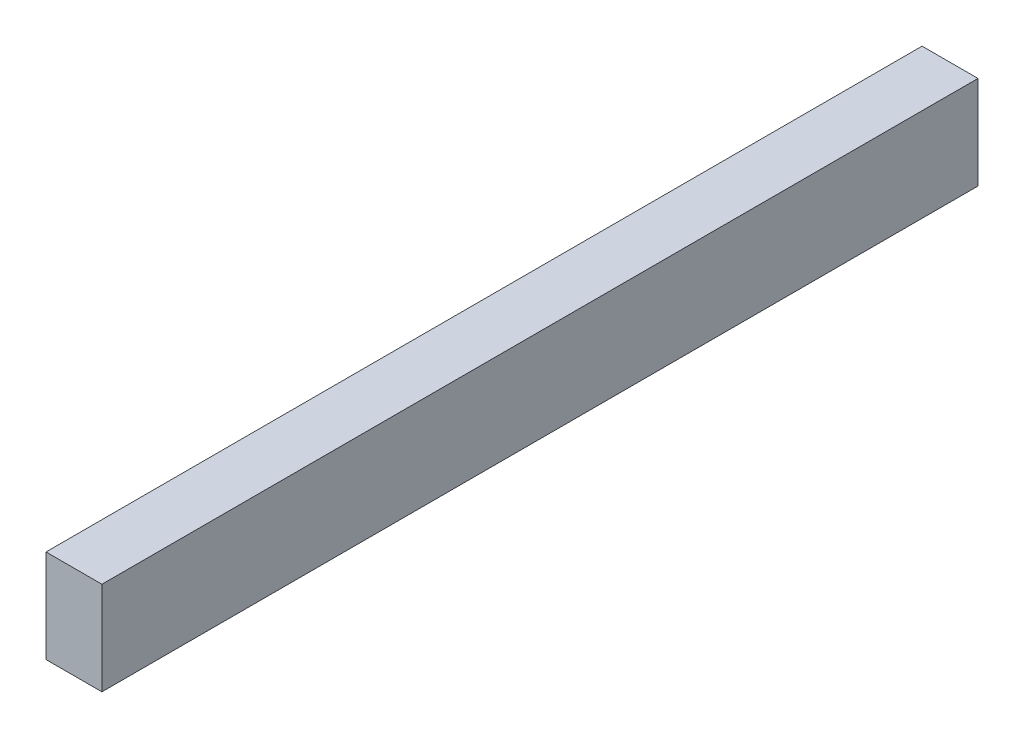
ISO-10303-21;
HEADER;
FILE_DESCRIPTION(('STEP AP214'),'2;1');
FILE_NAME('part.step','',(''),(''),'','','');
FILE_SCHEMA(('AUTOMOTIVE_DESIGN { 1 0 10303 214 1 1 1 1 }'));
ENDSEC;
DATA;
#1=APPLICATION_CONTEXT('core data for automotive mechanical design processes');
#2=APPLICATION_PROTOCOL_DEFINITION('international standard','automotive_design',2000,#1);
#3=PRODUCT_CONTEXT('',#1,'mechanical');
#4=PRODUCT('Part','Part','',(#3));
#5=PRODUCT_RELATED_PRODUCT_CATEGORY('part','',(#4));
#6=PRODUCT_DEFINITION_FORMATION('','',#4);
#7=PRODUCT_DEFINITION_CONTEXT('part definition',#1,'design');
#8=PRODUCT_DEFINITION('design','',#6,#7);
#9=PRODUCT_DEFINITION_SHAPE('','',#8);
#10=(LENGTH_UNIT() NAMED_UNIT(*) SI_UNIT(.MILLI.,.METRE.));
#11=(NAMED_UNIT(*) PLANE_ANGLE_UNIT() SI_UNIT($,.RADIAN.));
#12=(NAMED_UNIT(*) SI_UNIT($,.STERADIAN.) SOLID_ANGLE_UNIT());
#13=UNCERTAINTY_MEASURE_WITH_UNIT(LENGTH_MEASURE(1.E-05),#10,'distance_accuracy_value','');
#14=(GEOMETRIC_REPRESENTATION_CONTEXT(3) GLOBAL_UNCERTAINTY_ASSIGNED_CONTEXT((#13)) GLOBAL_UNIT_ASSIGNED_CONTEXT((#10,
#11,#12)) REPRESENTATION_CONTEXT('',''));
#15=CARTESIAN_POINT('',(0.,0.,0.));
#16=DIRECTION('',(0.,0.,1.));
#17=DIRECTION('',(1.,0.,0.));
#18=AXIS2_PLACEMENT_3D('',#15,#16,#17);
#19=CARTESIAN_POINT('',(19.05,-31.75,596.9));
#20=DIRECTION('',(-1.,0.,0.));
#21=DIRECTION('',(0.,0.,1.));
#22=AXIS2_PLACEMENT_3D('',#19,#20,#21);
#23=PLANE('',#22);
#24=DIRECTION('',(0.,1.,0.));
#25=VECTOR('',#24,1.);
#26=CARTESIAN_POINT('',(19.05,-31.75,0.));
#27=LINE('',#26,#25);
#28=CARTESIAN_POINT('',(19.05,-31.75,0.));
#29=VERTEX_POINT('',#28);
#30=CARTESIAN_POINT('',(19.05,31.75,0.));
#31=VERTEX_POINT('',#30);
#32=EDGE_CURVE('E96',#29,#31,#27,.T.);
#33=ORIENTED_EDGE('',*,*,#32,.T.);
#34=DIRECTION('',(0.,0.,-1.));
#35=VECTOR('',#34,1.);
#36=CARTESIAN_POINT('',(19.05,31.75,596.9));
#37=LINE('',#36,#35);
#38=CARTESIAN_POINT('',(19.05,31.75,596.9));
#39=VERTEX_POINT('',#38);
#40=EDGE_CURVE('E11',#39,#31,#37,.T.);
#41=ORIENTED_EDGE('',*,*,#40,.F.);
#42=DIRECTION('',(0.,1.,0.));
#43=VECTOR('',#42,1.);
#44=CARTESIAN_POINT('',(19.05,-31.75,596.9));
#45=LINE('',#44,#43);
#46=CARTESIAN_POINT('',(19.05,-31.75,596.9));
#47=VERTEX_POINT('',#46);
#48=EDGE_CURVE('E84',#47,#39,#45,.T.);
#49=ORIENTED_EDGE('',*,*,#48,.F.);
#50=DIRECTION('',(0.,0.,-1.));
#51=VECTOR('',#50,1.);
#52=CARTESIAN_POINT('',(19.05,-31.75,596.9));
#53=LINE('',#52,#51);
#54=EDGE_CURVE('E92',#47,#29,#53,.T.);
#55=ORIENTED_EDGE('',*,*,#54,.T.);
#56=EDGE_LOOP('',(#33,#41,#49,#55));
#57=FACE_BOUND('',#56,.T.);
#58=ADVANCED_FACE('F33',(#57),#23,.F.);
#59=CARTESIAN_POINT('',(-19.05,31.75,596.9));
#60=DIRECTION('',(0.,-1.,0.));
#61=DIRECTION('',(0.,0.,-1.));
#62=AXIS2_PLACEMENT_3D('',#59,#60,#61);
#63=PLANE('',#62);
#64=DIRECTION('',(-1.,0.,0.));
#65=VECTOR('',#64,1.);
#66=CARTESIAN_POINT('',(-19.05,31.75,0.));
#67=LINE('',#66,#65);
#68=CARTESIAN_POINT('',(-19.05,31.75,0.));
#69=VERTEX_POINT('',#68);
#70=EDGE_CURVE('E88',#31,#69,#67,.T.);
#71=ORIENTED_EDGE('',*,*,#70,.T.);
#72=DIRECTION('',(0.,0.,-1.));
#73=VECTOR('',#72,1.);
#74=CARTESIAN_POINT('',(-19.05,31.75,596.9));
#75=LINE('',#74,#73);
#76=CARTESIAN_POINT('',(-19.05,31.75,596.9));
#77=VERTEX_POINT('',#76);
#78=EDGE_CURVE('E41',#77,#69,#75,.T.);
#79=ORIENTED_EDGE('',*,*,#78,.F.);
#80=DIRECTION('',(-1.,0.,0.));
#81=VECTOR('',#80,1.);
#82=CARTESIAN_POINT('',(-19.05,31.75,596.9));
#83=LINE('',#82,#81);
#84=EDGE_CURVE('E79',#39,#77,#83,.T.);
#85=ORIENTED_EDGE('',*,*,#84,.F.);
#86=ORIENTED_EDGE('',*,*,#40,.T.);
#87=EDGE_LOOP('',(#71,#79,#85,#86));
#88=FACE_BOUND('',#87,.T.);
#89=ADVANCED_FACE('F87',(#88),#63,.F.);
#90=CARTESIAN_POINT('',(-19.05,-31.75,596.9));
#91=DIRECTION('',(1.,0.,0.));
#92=DIRECTION('',(0.,0.,-1.));
#93=AXIS2_PLACEMENT_3D('',#90,#91,#92);
#94=PLANE('',#93);
#95=DIRECTION('',(0.,-1.,0.));
#96=VECTOR('',#95,1.);
#97=CARTESIAN_POINT('',(-19.05,-31.75,0.));
#98=LINE('',#97,#96);
#99=CARTESIAN_POINT('',(-19.05,-31.75,0.));
#100=VERTEX_POINT('',#99);
#101=EDGE_CURVE('E66',#69,#100,#98,.T.);
#102=ORIENTED_EDGE('',*,*,#101,.T.);
#103=DIRECTION('',(0.,0.,-1.));
#104=VECTOR('',#103,1.);
#105=CARTESIAN_POINT('',(-19.05,-31.75,596.9));
#106=LINE('',#105,#104);
#107=CARTESIAN_POINT('',(-19.05,-31.75,596.9));
#108=VERTEX_POINT('',#107);
#109=EDGE_CURVE('E89',#108,#100,#106,.T.);
#110=ORIENTED_EDGE('',*,*,#109,.F.);
#111=DIRECTION('',(0.,-1.,0.));
#112=VECTOR('',#111,1.);
#113=CARTESIAN_POINT('',(-19.05,-31.75,596.9));
#114=LINE('',#113,#112);
#115=EDGE_CURVE('E82',#77,#108,#114,.T.);
#116=ORIENTED_EDGE('',*,*,#115,.F.);
#117=ORIENTED_EDGE('',*,*,#78,.T.);
#118=EDGE_LOOP('',(#102,#110,#116,#117));
#119=FACE_BOUND('',#118,.T.);
#120=ADVANCED_FACE('F90',(#119),#94,.F.);
#121=CARTESIAN_POINT('',(-19.05,-31.75,596.9));
#122=DIRECTION('',(0.,1.,0.));
#123=DIRECTION('',(0.,0.,1.));
#124=AXIS2_PLACEMENT_3D('',#121,#122,#123);
#125=PLANE('',#124);
#126=DIRECTION('',(1.,0.,0.));
#127=VECTOR('',#126,1.);
#128=CARTESIAN_POINT('',(-19.05,-31.75,0.));
#129=LINE('',#128,#127);
#130=EDGE_CURVE('E72',#100,#29,#129,.T.);
#131=ORIENTED_EDGE('',*,*,#130,.T.);
#132=ORIENTED_EDGE('',*,*,#54,.F.);
#133=DIRECTION('',(1.,0.,0.));
#134=VECTOR('',#133,1.);
#135=CARTESIAN_POINT('',(-19.05,-31.75,596.9));
#136=LINE('',#135,#134);
#137=EDGE_CURVE('E49',#108,#47,#136,.T.);
#138=ORIENTED_EDGE('',*,*,#137,.F.);
#139=ORIENTED_EDGE('',*,*,#109,.T.);
#140=EDGE_LOOP('',(#131,#132,#138,#139));
#141=FACE_BOUND('',#140,.T.);
#142=ADVANCED_FACE('F103',(#141),#125,.F.);
#143=CARTESIAN_POINT('',(0.,0.,596.9));
#144=DIRECTION('',(0.,0.,-1.));
#145=DIRECTION('',(-1.,0.,0.));
#146=AXIS2_PLACEMENT_3D('',#143,#144,#145);
#147=PLANE('',#146);
#148=ORIENTED_EDGE('',*,*,#48,.T.);
#149=ORIENTED_EDGE('',*,*,#84,.T.);
#150=ORIENTED_EDGE('',*,*,#115,.T.);
#151=ORIENTED_EDGE('',*,*,#137,.T.);
#152=EDGE_LOOP('',(#148,#149,#150,#151));
#153=FACE_BOUND('',#152,.T.);
#154=ADVANCED_FACE('F80',(#153),#147,.F.);
#155=CARTESIAN_POINT('',(0.,0.,0.));
#156=DIRECTION('',(0.,0.,-1.));
#157=DIRECTION('',(-1.,0.,0.));
#158=AXIS2_PLACEMENT_3D('',#155,#156,#157);
#159=PLANE('',#158);
#160=ORIENTED_EDGE('',*,*,#32,.F.);
#161=ORIENTED_EDGE('',*,*,#130,.F.);
#162=ORIENTED_EDGE('',*,*,#101,.F.);
#163=ORIENTED_EDGE('',*,*,#70,.F.);
#164=EDGE_LOOP('',(#160,#161,#162,#163));
#165=FACE_BOUND('',#164,.T.);
#166=ADVANCED_FACE('F106',(#165),#159,.T.);
#167=CLOSED_SHELL('',(#58,#89,#120,#142,#154,#166));
#168=MANIFOLD_SOLID_BREP('B2',#167);
#169=ADVANCED_BREP_SHAPE_REPRESENTATION('',(#18,#168),#14);
#170=SHAPE_DEFINITION_REPRESENTATION(#9,#169);
ENDSEC;
END-ISO-10303-21;
